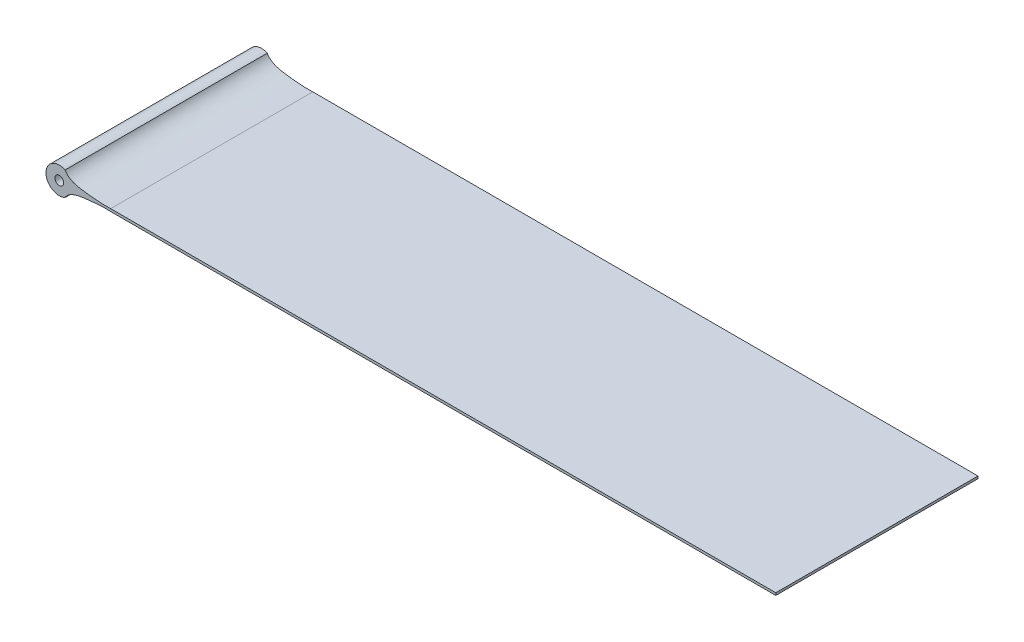
ISO-10303-21;
HEADER;
FILE_DESCRIPTION(('STEP AP214'),'2;1');
FILE_NAME('part.step','',(''),(''),'','','');
FILE_SCHEMA(('AUTOMOTIVE_DESIGN { 1 0 10303 214 1 1 1 1 }'));
ENDSEC;
DATA;
#1=APPLICATION_CONTEXT('core data for automotive mechanical design processes');
#2=APPLICATION_PROTOCOL_DEFINITION('international standard','automotive_design',2000,#1);
#3=PRODUCT_CONTEXT('',#1,'mechanical');
#4=PRODUCT('Part','Part','',(#3));
#5=PRODUCT_RELATED_PRODUCT_CATEGORY('part','',(#4));
#6=PRODUCT_DEFINITION_FORMATION('','',#4);
#7=PRODUCT_DEFINITION_CONTEXT('part definition',#1,'design');
#8=PRODUCT_DEFINITION('design','',#6,#7);
#9=PRODUCT_DEFINITION_SHAPE('','',#8);
#10=(LENGTH_UNIT() NAMED_UNIT(*) SI_UNIT(.MILLI.,.METRE.));
#11=(NAMED_UNIT(*) PLANE_ANGLE_UNIT() SI_UNIT($,.RADIAN.));
#12=(NAMED_UNIT(*) SI_UNIT($,.STERADIAN.) SOLID_ANGLE_UNIT());
#13=UNCERTAINTY_MEASURE_WITH_UNIT(LENGTH_MEASURE(1.E-05),#10,'distance_accuracy_value','');
#14=(GEOMETRIC_REPRESENTATION_CONTEXT(3) GLOBAL_UNCERTAINTY_ASSIGNED_CONTEXT((#13)) GLOBAL_UNIT_ASSIGNED_CONTEXT((#10,
#11,#12)) REPRESENTATION_CONTEXT('',''));
#15=CARTESIAN_POINT('',(0.,0.,0.));
#16=DIRECTION('',(0.,0.,1.));
#17=DIRECTION('',(1.,0.,0.));
#18=AXIS2_PLACEMENT_3D('',#15,#16,#17);
#19=CARTESIAN_POINT('',(5.79106042189603,0.142064291886772,-11.4));
#20=CARTESIAN_POINT('',(5.02928419436243,0.0872995382050483,-11.4));
#21=CARTESIAN_POINT('',(3.06989768779248,0.268204079339744,-11.4));
#22=CARTESIAN_POINT('',(1.11451762207765,0.510365175091929,-11.4));
#23=CARTESIAN_POINT('',(0.650938463154797,1.35139894819615,-11.4));
#24=B_SPLINE_CURVE_WITH_KNOTS('',3,(#19,#20,#21,#22,#23),.UNSPECIFIED.,.F.,.F.,(4,1,4),(0.,
0.385279429338953,1.),.UNSPECIFIED.);
#25=DIRECTION('',(0.,0.,1.));
#26=VECTOR('',#25,1.);
#27=SURFACE_OF_LINEAR_EXTRUSION('',#24,#26);
#28=DIRECTION('',(0.,0.,1.));
#29=VECTOR('',#28,1.);
#30=CARTESIAN_POINT('',(0.650938463154797,1.35139894819615,-11.4));
#31=LINE('',#30,#29);
#32=CARTESIAN_POINT('',(0.650938463154797,1.35139894819615,-11.4));
#33=VERTEX_POINT('',#32);
#34=CARTESIAN_POINT('',(0.650938463154797,1.35139894819615,11.4));
#35=VERTEX_POINT('',#34);
#36=EDGE_CURVE('E38',#33,#35,#31,.T.);
#37=ORIENTED_EDGE('',*,*,#36,.T.);
#38=CARTESIAN_POINT('',(5.79106042189603,0.142064291886772,11.4));
#39=CARTESIAN_POINT('',(5.02928419436243,0.0872995382050483,11.4));
#40=CARTESIAN_POINT('',(3.06989768779248,0.268204079339744,11.4));
#41=CARTESIAN_POINT('',(1.11451762207765,0.510365175091929,11.4));
#42=CARTESIAN_POINT('',(0.650938463154797,1.35139894819615,11.4));
#43=B_SPLINE_CURVE_WITH_KNOTS('',3,(#38,#39,#40,#41,#42),.UNSPECIFIED.,.F.,.F.,(4,1,4),(0.,
0.385279429338953,1.),.UNSPECIFIED.);
#44=CARTESIAN_POINT('',(5.79106042189602,0.142064291886772,11.4));
#45=VERTEX_POINT('',#44);
#46=EDGE_CURVE('E87',#45,#35,#43,.T.);
#47=ORIENTED_EDGE('',*,*,#46,.F.);
#48=DIRECTION('',(0.,0.,1.));
#49=VECTOR('',#48,1.);
#50=CARTESIAN_POINT('',(5.79106042189602,0.142064291886772,-11.4));
#51=LINE('',#50,#49);
#52=CARTESIAN_POINT('',(5.79106042189602,0.142064291886772,-11.4));
#53=VERTEX_POINT('',#52);
#54=EDGE_CURVE('E11',#53,#45,#51,.T.);
#55=ORIENTED_EDGE('',*,*,#54,.F.);
#56=EDGE_CURVE('E88',#53,#33,#24,.T.);
#57=ORIENTED_EDGE('',*,*,#56,.T.);
#58=EDGE_LOOP('',(#37,#47,#55,#57));
#59=FACE_BOUND('',#58,.T.);
#60=ADVANCED_FACE('F34',(#59),#27,.T.);
#61=CARTESIAN_POINT('',(5.79106042189602,0.142064291886772,-11.4));
#62=DIRECTION('',(0.000117717117461543,0.99999999307134,0.));
#63=DIRECTION('',(-0.99999999307134,0.000117717117461543,0.));
#64=AXIS2_PLACEMENT_3D('',#61,#62,#63);
#65=PLANE('',#64);
#66=ORIENTED_EDGE('',*,*,#54,.T.);
#67=DIRECTION('',(-0.99999999307134,0.000117717117461543,0.));
#68=VECTOR('',#67,1.);
#69=CARTESIAN_POINT('',(5.79106042189602,0.142064291886772,11.4));
#70=LINE('',#69,#68);
#71=CARTESIAN_POINT('',(80.791060421896,0.133235508015997,11.4));
#72=VERTEX_POINT('',#71);
#73=EDGE_CURVE('E106',#72,#45,#70,.T.);
#74=ORIENTED_EDGE('',*,*,#73,.F.);
#75=DIRECTION('',(0.,0.,1.));
#76=VECTOR('',#75,1.);
#77=CARTESIAN_POINT('',(80.791060421896,0.133235508015997,-11.4));
#78=LINE('',#77,#76);
#79=CARTESIAN_POINT('',(80.791060421896,0.133235508015997,-11.4));
#80=VERTEX_POINT('',#79);
#81=EDGE_CURVE('E43',#80,#72,#78,.T.);
#82=ORIENTED_EDGE('',*,*,#81,.F.);
#83=DIRECTION('',(-0.99999999307134,0.000117717117461543,0.));
#84=VECTOR('',#83,1.);
#85=CARTESIAN_POINT('',(5.79106042189602,0.142064291886772,-11.4));
#86=LINE('',#85,#84);
#87=EDGE_CURVE('E93',#80,#53,#86,.T.);
#88=ORIENTED_EDGE('',*,*,#87,.T.);
#89=EDGE_LOOP('',(#66,#74,#82,#88));
#90=FACE_BOUND('',#89,.T.);
#91=ADVANCED_FACE('F167',(#90),#65,.T.);
#92=CARTESIAN_POINT('',(20.6774192585669,0.,-11.4));
#93=DIRECTION('',(0.,0.,1.));
#94=DIRECTION('',(1.,0.,0.));
#95=AXIS2_PLACEMENT_3D('',#92,#93,#94);
#96=CYLINDRICAL_SURFACE('',#95,60.1137888143319);
#97=ORIENTED_EDGE('',*,*,#81,.T.);
#98=CARTESIAN_POINT('',(20.6774192585669,0.,11.4));
#99=DIRECTION('',(0.,0.,1.));
#100=DIRECTION('',(-1.,0.,0.));
#101=AXIS2_PLACEMENT_3D('',#98,#99,#100);
#102=CIRCLE('',#101,60.1137888143319);
#103=CARTESIAN_POINT('',(80.791060421896,-0.133235508015984,11.4));
#104=VERTEX_POINT('',#103);
#105=EDGE_CURVE('E126',#104,#72,#102,.T.);
#106=ORIENTED_EDGE('',*,*,#105,.F.);
#107=DIRECTION('',(0.,0.,1.));
#108=VECTOR('',#107,1.);
#109=CARTESIAN_POINT('',(80.791060421896,-0.133235508015984,-11.4));
#110=LINE('',#109,#108);
#111=CARTESIAN_POINT('',(80.791060421896,-0.133235508015984,-11.4));
#112=VERTEX_POINT('',#111);
#113=EDGE_CURVE('E232',#112,#104,#110,.T.);
#114=ORIENTED_EDGE('',*,*,#113,.F.);
#115=CARTESIAN_POINT('',(20.6774192585669,0.,-11.4));
#116=DIRECTION('',(0.,0.,1.));
#117=DIRECTION('',(-1.,0.,0.));
#118=AXIS2_PLACEMENT_3D('',#115,#116,#117);
#119=CIRCLE('',#118,60.1137888143319);
#120=EDGE_CURVE('E238',#112,#80,#119,.T.);
#121=ORIENTED_EDGE('',*,*,#120,.T.);
#122=EDGE_LOOP('',(#97,#106,#114,#121));
#123=FACE_BOUND('',#122,.T.);
#124=ADVANCED_FACE('F172',(#123),#96,.T.);
#125=CARTESIAN_POINT('',(5.79106042189602,-0.142064291886772,-11.4));
#126=DIRECTION('',(0.000117717117461543,-0.99999999307134,0.));
#127=DIRECTION('',(0.99999999307134,0.000117717117461543,0.));
#128=AXIS2_PLACEMENT_3D('',#125,#126,#127);
#129=PLANE('',#128);
#130=ORIENTED_EDGE('',*,*,#113,.T.);
#131=DIRECTION('',(0.99999999307134,0.000117717117461543,0.));
#132=VECTOR('',#131,1.);
#133=CARTESIAN_POINT('',(5.79106042189602,-0.142064291886772,11.4));
#134=LINE('',#133,#132);
#135=CARTESIAN_POINT('',(5.79106042189603,-0.142064291886772,11.4));
#136=VERTEX_POINT('',#135);
#137=EDGE_CURVE('E120',#136,#104,#134,.T.);
#138=ORIENTED_EDGE('',*,*,#137,.F.);
#139=DIRECTION('',(0.,0.,1.));
#140=VECTOR('',#139,1.);
#141=CARTESIAN_POINT('',(5.79106042189603,-0.142064291886772,-11.4));
#142=LINE('',#141,#140);
#143=CARTESIAN_POINT('',(5.79106042189603,-0.142064291886772,-11.4));
#144=VERTEX_POINT('',#143);
#145=EDGE_CURVE('E236',#144,#136,#142,.T.);
#146=ORIENTED_EDGE('',*,*,#145,.F.);
#147=DIRECTION('',(0.99999999307134,0.000117717117461543,0.));
#148=VECTOR('',#147,1.);
#149=CARTESIAN_POINT('',(5.79106042189602,-0.142064291886772,-11.4));
#150=LINE('',#149,#148);
#151=EDGE_CURVE('E146',#144,#112,#150,.T.);
#152=ORIENTED_EDGE('',*,*,#151,.T.);
#153=EDGE_LOOP('',(#130,#138,#146,#152));
#154=FACE_BOUND('',#153,.T.);
#155=ADVANCED_FACE('F155',(#154),#129,.T.);
#156=CARTESIAN_POINT('',(0.650938463154797,-1.35139894819615,-11.4));
#157=CARTESIAN_POINT('',(1.11451762207765,-0.510365175091928,-11.4));
#158=CARTESIAN_POINT('',(3.06989768779248,-0.268204079339744,-11.4));
#159=CARTESIAN_POINT('',(5.02928419436243,-0.0872995382050483,-11.4));
#160=CARTESIAN_POINT('',(5.79106042189603,-0.142064291886772,-11.4));
#161=B_SPLINE_CURVE_WITH_KNOTS('',3,(#156,#157,#158,#159,#160),.UNSPECIFIED.,.F.,.F.,(4,1,4),
(0.,0.614720570661047,1.),.UNSPECIFIED.);
#162=DIRECTION('',(0.,0.,1.));
#163=VECTOR('',#162,1.);
#164=SURFACE_OF_LINEAR_EXTRUSION('',#161,#163);
#165=ORIENTED_EDGE('',*,*,#145,.T.);
#166=CARTESIAN_POINT('',(0.650938463154797,-1.35139894819615,11.4));
#167=CARTESIAN_POINT('',(1.11451762207765,-0.510365175091928,11.4));
#168=CARTESIAN_POINT('',(3.06989768779248,-0.268204079339744,11.4));
#169=CARTESIAN_POINT('',(5.02928419436243,-0.0872995382050483,11.4));
#170=CARTESIAN_POINT('',(5.79106042189603,-0.142064291886772,11.4));
#171=B_SPLINE_CURVE_WITH_KNOTS('',3,(#166,#167,#168,#169,#170),.UNSPECIFIED.,.F.,.F.,(4,1,4),
(0.,0.614720570661047,1.),.UNSPECIFIED.);
#172=CARTESIAN_POINT('',(0.650938463154796,-1.35139894819615,11.4));
#173=VERTEX_POINT('',#172);
#174=EDGE_CURVE('E100',#173,#136,#171,.T.);
#175=ORIENTED_EDGE('',*,*,#174,.F.);
#176=DIRECTION('',(0.,0.,1.));
#177=VECTOR('',#176,1.);
#178=CARTESIAN_POINT('',(0.650938463154796,-1.35139894819615,-11.4));
#179=LINE('',#178,#177);
#180=CARTESIAN_POINT('',(0.650938463154796,-1.35139894819615,-11.4));
#181=VERTEX_POINT('',#180);
#182=EDGE_CURVE('E92',#181,#173,#179,.T.);
#183=ORIENTED_EDGE('',*,*,#182,.F.);
#184=EDGE_CURVE('E140',#181,#144,#161,.T.);
#185=ORIENTED_EDGE('',*,*,#184,.T.);
#186=EDGE_LOOP('',(#165,#175,#183,#185));
#187=FACE_BOUND('',#186,.T.);
#188=ADVANCED_FACE('F152',(#187),#164,.T.);
#189=CARTESIAN_POINT('',(0.,0.,-11.4));
#190=DIRECTION('',(0.,0.,1.));
#191=DIRECTION('',(1.,0.,0.));
#192=AXIS2_PLACEMENT_3D('',#189,#190,#191);
#193=CYLINDRICAL_SURFACE('',#192,1.5);
#194=ORIENTED_EDGE('',*,*,#182,.T.);
#195=CARTESIAN_POINT('',(0.,0.,11.4));
#196=DIRECTION('',(0.,0.,1.));
#197=DIRECTION('',(1.,0.,0.));
#198=AXIS2_PLACEMENT_3D('',#195,#196,#197);
#199=CIRCLE('',#198,1.5);
#200=EDGE_CURVE('E95',#35,#173,#199,.T.);
#201=ORIENTED_EDGE('',*,*,#200,.F.);
#202=ORIENTED_EDGE('',*,*,#36,.F.);
#203=CARTESIAN_POINT('',(0.,0.,-11.4));
#204=DIRECTION('',(0.,0.,1.));
#205=DIRECTION('',(1.,0.,0.));
#206=AXIS2_PLACEMENT_3D('',#203,#204,#205);
#207=CIRCLE('',#206,1.5);
#208=EDGE_CURVE('E135',#33,#181,#207,.T.);
#209=ORIENTED_EDGE('',*,*,#208,.T.);
#210=EDGE_LOOP('',(#194,#201,#202,#209));
#211=FACE_BOUND('',#210,.T.);
#212=ADVANCED_FACE('F96',(#211),#193,.T.);
#213=CARTESIAN_POINT('',(2.85118962307101,0.312940002441258,-11.4));
#214=DIRECTION('',(0.,0.,-1.));
#215=DIRECTION('',(-1.,0.,0.));
#216=AXIS2_PLACEMENT_3D('',#213,#214,#215);
#217=PLANE('',#216);
#218=CARTESIAN_POINT('',(0.,0.,-11.4));
#219=DIRECTION('',(0.,0.,1.));
#220=DIRECTION('',(1.,0.,0.));
#221=AXIS2_PLACEMENT_3D('',#218,#219,#220);
#222=CIRCLE('',#221,0.5);
#223=CARTESIAN_POINT('',(0.5,0.,-11.4));
#224=VERTEX_POINT('',#223);
#225=EDGE_CURVE('E129',#224,#224,#222,.T.);
#226=ORIENTED_EDGE('',*,*,#225,.T.);
#227=EDGE_LOOP('',(#226));
#228=FACE_BOUND('',#227,.T.);
#229=ORIENTED_EDGE('',*,*,#56,.F.);
#230=ORIENTED_EDGE('',*,*,#87,.F.);
#231=ORIENTED_EDGE('',*,*,#120,.F.);
#232=ORIENTED_EDGE('',*,*,#151,.F.);
#233=ORIENTED_EDGE('',*,*,#184,.F.);
#234=ORIENTED_EDGE('',*,*,#208,.F.);
#235=EDGE_LOOP('',(#229,#230,#231,#232,#233,#234));
#236=FACE_BOUND('',#235,.T.);
#237=ADVANCED_FACE('F159',(#228,#236),#217,.T.);
#238=CARTESIAN_POINT('',(0.,0.,-11.4));
#239=DIRECTION('',(0.,0.,1.));
#240=DIRECTION('',(1.,0.,0.));
#241=AXIS2_PLACEMENT_3D('',#238,#239,#240);
#242=CYLINDRICAL_SURFACE('',#241,0.5);
#243=ORIENTED_EDGE('',*,*,#225,.F.);
#244=EDGE_LOOP('',(#243));
#245=FACE_BOUND('',#244,.T.);
#246=CARTESIAN_POINT('',(0.,0.,11.4));
#247=DIRECTION('',(0.,0.,1.));
#248=DIRECTION('',(1.,0.,0.));
#249=AXIS2_PLACEMENT_3D('',#246,#247,#248);
#250=CIRCLE('',#249,0.5);
#251=CARTESIAN_POINT('',(0.5,0.,11.4));
#252=VERTEX_POINT('',#251);
#253=EDGE_CURVE('E107',#252,#252,#250,.T.);
#254=ORIENTED_EDGE('',*,*,#253,.T.);
#255=EDGE_LOOP('',(#254));
#256=FACE_BOUND('',#255,.T.);
#257=ADVANCED_FACE('F163',(#245,#256),#242,.F.);
#258=CARTESIAN_POINT('',(2.85118962307101,0.312940002441258,11.4));
#259=DIRECTION('',(0.,0.,-1.));
#260=DIRECTION('',(-1.,0.,0.));
#261=AXIS2_PLACEMENT_3D('',#258,#259,#260);
#262=PLANE('',#261);
#263=ORIENTED_EDGE('',*,*,#46,.T.);
#264=ORIENTED_EDGE('',*,*,#200,.T.);
#265=ORIENTED_EDGE('',*,*,#174,.T.);
#266=ORIENTED_EDGE('',*,*,#137,.T.);
#267=ORIENTED_EDGE('',*,*,#105,.T.);
#268=ORIENTED_EDGE('',*,*,#73,.T.);
#269=EDGE_LOOP('',(#263,#264,#265,#266,#267,#268));
#270=FACE_BOUND('',#269,.T.);
#271=ORIENTED_EDGE('',*,*,#253,.F.);
#272=EDGE_LOOP('',(#271));
#273=FACE_BOUND('',#272,.T.);
#274=ADVANCED_FACE('F103',(#270,#273),#262,.F.);
#275=CLOSED_SHELL('',(#60,#91,#124,#155,#188,#212,#237,#257,#274));
#276=MANIFOLD_SOLID_BREP('B2',#275);
#277=ADVANCED_BREP_SHAPE_REPRESENTATION('',(#18,#276),#14);
#278=SHAPE_DEFINITION_REPRESENTATION(#9,#277);
ENDSEC;
END-ISO-10303-21;
